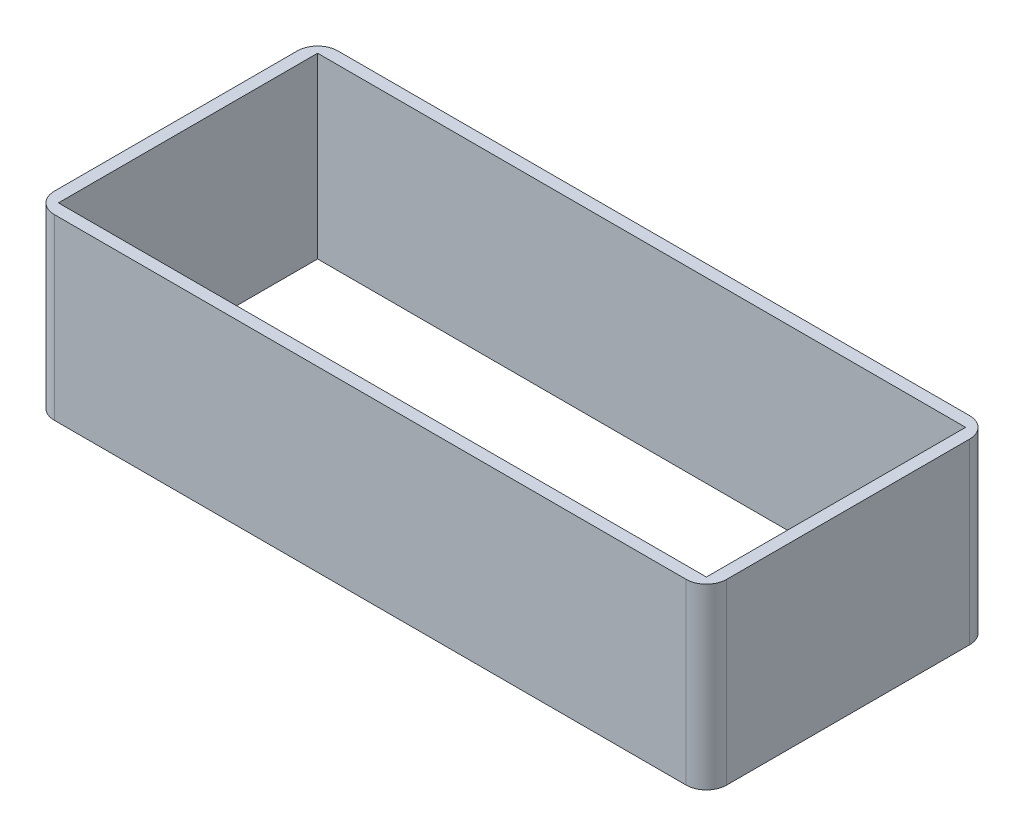
ISO-10303-21;
HEADER;
FILE_DESCRIPTION(('STEP AP214'),'2;1');
FILE_NAME('part.step','',(''),(''),'','','');
FILE_SCHEMA(('AUTOMOTIVE_DESIGN { 1 0 10303 214 1 1 1 1 }'));
ENDSEC;
DATA;
#1=APPLICATION_CONTEXT('core data for automotive mechanical design processes');
#2=APPLICATION_PROTOCOL_DEFINITION('international standard','automotive_design',2000,#1);
#3=PRODUCT_CONTEXT('',#1,'mechanical');
#4=PRODUCT('Part','Part','',(#3));
#5=PRODUCT_RELATED_PRODUCT_CATEGORY('part','',(#4));
#6=PRODUCT_DEFINITION_FORMATION('','',#4);
#7=PRODUCT_DEFINITION_CONTEXT('part definition',#1,'design');
#8=PRODUCT_DEFINITION('design','',#6,#7);
#9=PRODUCT_DEFINITION_SHAPE('','',#8);
#10=(LENGTH_UNIT() NAMED_UNIT(*) SI_UNIT(.MILLI.,.METRE.));
#11=(NAMED_UNIT(*) PLANE_ANGLE_UNIT() SI_UNIT($,.RADIAN.));
#12=(NAMED_UNIT(*) SI_UNIT($,.STERADIAN.) SOLID_ANGLE_UNIT());
#13=UNCERTAINTY_MEASURE_WITH_UNIT(LENGTH_MEASURE(1.E-05),#10,'distance_accuracy_value','');
#14=(GEOMETRIC_REPRESENTATION_CONTEXT(3) GLOBAL_UNCERTAINTY_ASSIGNED_CONTEXT((#13)) GLOBAL_UNIT_ASSIGNED_CONTEXT((#10,
#11,#12)) REPRESENTATION_CONTEXT('',''));
#15=CARTESIAN_POINT('',(0.,0.,0.));
#16=DIRECTION('',(0.,0.,1.));
#17=DIRECTION('',(1.,0.,0.));
#18=AXIS2_PLACEMENT_3D('',#15,#16,#17);
#19=CARTESIAN_POINT('',(0.,47.,0.));
#20=DIRECTION('',(0.,1.,0.));
#21=DIRECTION('',(0.,0.,1.));
#22=AXIS2_PLACEMENT_3D('',#19,#20,#21);
#23=PLANE('',#22);
#24=DIRECTION('',(0.,0.,1.));
#25=VECTOR('',#24,1.);
#26=CARTESIAN_POINT('',(-95.3544303797468,47.,-47.8481012658228));
#27=LINE('',#26,#25);
#28=CARTESIAN_POINT('',(-95.3544303797468,47.,-44.8481012658228));
#29=VERTEX_POINT('',#28);
#30=CARTESIAN_POINT('',(-95.3544303797468,47.,19.1518987341772));
#31=VERTEX_POINT('',#30);
#32=EDGE_CURVE('E11',#29,#31,#27,.T.);
#33=ORIENTED_EDGE('',*,*,#32,.F.);
#34=DIRECTION('',(-1.,0.,0.));
#35=VECTOR('',#34,1.);
#36=CARTESIAN_POINT('',(-98.3544303797468,47.,-44.8481012658228));
#37=LINE('',#36,#35);
#38=CARTESIAN_POINT('',(64.6371308016878,47.,-44.8481012658228));
#39=VERTEX_POINT('',#38);
#40=EDGE_CURVE('E193',#39,#29,#37,.T.);
#41=ORIENTED_EDGE('',*,*,#40,.F.);
#42=DIRECTION('',(0.,0.,-1.));
#43=VECTOR('',#42,1.);
#44=CARTESIAN_POINT('',(64.6371308016878,47.,-47.8481012658228));
#45=LINE('',#44,#43);
#46=CARTESIAN_POINT('',(64.6371308016878,47.,19.1518987341772));
#47=VERTEX_POINT('',#46);
#48=EDGE_CURVE('E196',#47,#39,#45,.T.);
#49=ORIENTED_EDGE('',*,*,#48,.F.);
#50=DIRECTION('',(1.,0.,0.));
#51=VECTOR('',#50,1.);
#52=CARTESIAN_POINT('',(-98.3544303797468,47.,19.1518987341772));
#53=LINE('',#52,#51);
#54=EDGE_CURVE('E41',#31,#47,#53,.T.);
#55=ORIENTED_EDGE('',*,*,#54,.F.);
#56=EDGE_LOOP('',(#33,#41,#49,#55));
#57=FACE_BOUND('',#56,.T.);
#58=CARTESIAN_POINT('',(62.6371308016877,47.,-42.8481012658228));
#59=DIRECTION('',(0.,1.,0.));
#60=DIRECTION('',(0.,0.,1.));
#61=AXIS2_PLACEMENT_3D('',#58,#59,#60);
#62=CIRCLE('',#61,5.);
#63=CARTESIAN_POINT('',(62.6371308016877,47.,-47.8481012658228));
#64=VERTEX_POINT('',#63);
#65=CARTESIAN_POINT('',(67.6371308016878,47.,-42.8481012658228));
#66=VERTEX_POINT('',#65);
#67=EDGE_CURVE('E185',#64,#66,#62,.F.);
#68=ORIENTED_EDGE('',*,*,#67,.F.);
#69=DIRECTION('',(-1.,0.,0.));
#70=VECTOR('',#69,1.);
#71=CARTESIAN_POINT('',(-98.3544303797468,47.,-47.8481012658228));
#72=LINE('',#71,#70);
#73=CARTESIAN_POINT('',(-93.3544303797468,47.,-47.8481012658228));
#74=VERTEX_POINT('',#73);
#75=EDGE_CURVE('E166',#64,#74,#72,.T.);
#76=ORIENTED_EDGE('',*,*,#75,.T.);
#77=CARTESIAN_POINT('',(-93.3544303797468,47.,-42.8481012658228));
#78=DIRECTION('',(0.,1.,0.));
#79=DIRECTION('',(0.,0.,1.));
#80=AXIS2_PLACEMENT_3D('',#77,#78,#79);
#81=CIRCLE('',#80,5.);
#82=CARTESIAN_POINT('',(-98.3544303797468,47.,-42.8481012658228));
#83=VERTEX_POINT('',#82);
#84=EDGE_CURVE('E182',#83,#74,#81,.F.);
#85=ORIENTED_EDGE('',*,*,#84,.F.);
#86=DIRECTION('',(0.,0.,1.));
#87=VECTOR('',#86,1.);
#88=CARTESIAN_POINT('',(-98.3544303797468,47.,-47.8481012658228));
#89=LINE('',#88,#87);
#90=CARTESIAN_POINT('',(-98.3544303797468,47.,17.1518987341772));
#91=VERTEX_POINT('',#90);
#92=EDGE_CURVE('E179',#83,#91,#89,.T.);
#93=ORIENTED_EDGE('',*,*,#92,.T.);
#94=CARTESIAN_POINT('',(-93.3544303797468,47.,17.1518987341772));
#95=DIRECTION('',(0.,1.,0.));
#96=DIRECTION('',(0.,0.,1.));
#97=AXIS2_PLACEMENT_3D('',#94,#95,#96);
#98=CIRCLE('',#97,5.);
#99=CARTESIAN_POINT('',(-93.3544303797468,47.,22.1518987341772));
#100=VERTEX_POINT('',#99);
#101=EDGE_CURVE('E191',#100,#91,#98,.F.);
#102=ORIENTED_EDGE('',*,*,#101,.F.);
#103=DIRECTION('',(1.,0.,0.));
#104=VECTOR('',#103,1.);
#105=CARTESIAN_POINT('',(-98.3544303797468,47.,22.1518987341772));
#106=LINE('',#105,#104);
#107=CARTESIAN_POINT('',(62.6371308016878,47.,22.1518987341772));
#108=VERTEX_POINT('',#107);
#109=EDGE_CURVE('E175',#100,#108,#106,.T.);
#110=ORIENTED_EDGE('',*,*,#109,.T.);
#111=CARTESIAN_POINT('',(62.6371308016878,47.,17.1518987341772));
#112=DIRECTION('',(0.,1.,0.));
#113=DIRECTION('',(0.,0.,1.));
#114=AXIS2_PLACEMENT_3D('',#111,#112,#113);
#115=CIRCLE('',#114,5.);
#116=CARTESIAN_POINT('',(67.6371308016878,47.,17.1518987341772));
#117=VERTEX_POINT('',#116);
#118=EDGE_CURVE('E188',#117,#108,#115,.F.);
#119=ORIENTED_EDGE('',*,*,#118,.F.);
#120=DIRECTION('',(0.,0.,-1.));
#121=VECTOR('',#120,1.);
#122=CARTESIAN_POINT('',(67.6371308016878,47.,-47.8481012658228));
#123=LINE('',#122,#121);
#124=EDGE_CURVE('E171',#117,#66,#123,.T.);
#125=ORIENTED_EDGE('',*,*,#124,.T.);
#126=EDGE_LOOP('',(#68,#76,#85,#93,#102,#110,#119,#125));
#127=FACE_BOUND('',#126,.T.);
#128=ADVANCED_FACE('F33',(#57,#127),#23,.T.);
#129=CARTESIAN_POINT('',(0.,3.,0.));
#130=DIRECTION('',(0.,-1.,0.));
#131=DIRECTION('',(0.,0.,-1.));
#132=AXIS2_PLACEMENT_3D('',#129,#130,#131);
#133=PLANE('',#132);
#134=DIRECTION('',(-1.,0.,0.));
#135=VECTOR('',#134,1.);
#136=CARTESIAN_POINT('',(-98.3544303797468,3.,-44.8481012658228));
#137=LINE('',#136,#135);
#138=CARTESIAN_POINT('',(64.6371308016878,3.,-44.8481012658228));
#139=VERTEX_POINT('',#138);
#140=CARTESIAN_POINT('',(-95.3544303797468,3.,-44.8481012658228));
#141=VERTEX_POINT('',#140);
#142=EDGE_CURVE('E138',#139,#141,#137,.T.);
#143=ORIENTED_EDGE('',*,*,#142,.T.);
#144=DIRECTION('',(0.,0.,1.));
#145=VECTOR('',#144,1.);
#146=CARTESIAN_POINT('',(-95.3544303797468,3.,-47.8481012658228));
#147=LINE('',#146,#145);
#148=CARTESIAN_POINT('',(-95.3544303797468,3.,19.1518987341772));
#149=VERTEX_POINT('',#148);
#150=EDGE_CURVE('E121',#141,#149,#147,.T.);
#151=ORIENTED_EDGE('',*,*,#150,.T.);
#152=DIRECTION('',(1.,0.,0.));
#153=VECTOR('',#152,1.);
#154=CARTESIAN_POINT('',(-98.3544303797468,3.,19.1518987341772));
#155=LINE('',#154,#153);
#156=CARTESIAN_POINT('',(64.6371308016878,3.,19.1518987341772));
#157=VERTEX_POINT('',#156);
#158=EDGE_CURVE('E126',#149,#157,#155,.T.);
#159=ORIENTED_EDGE('',*,*,#158,.T.);
#160=DIRECTION('',(0.,0.,-1.));
#161=VECTOR('',#160,1.);
#162=CARTESIAN_POINT('',(64.6371308016878,3.,-47.8481012658228));
#163=LINE('',#162,#161);
#164=EDGE_CURVE('E132',#157,#139,#163,.T.);
#165=ORIENTED_EDGE('',*,*,#164,.T.);
#166=EDGE_LOOP('',(#143,#151,#159,#165));
#167=FACE_BOUND('',#166,.T.);
#168=CARTESIAN_POINT('',(62.6371308016877,3.,-42.8481012658228));
#169=DIRECTION('',(0.,-1.,0.));
#170=DIRECTION('',(0.,0.,-1.));
#171=AXIS2_PLACEMENT_3D('',#168,#169,#170);
#172=CIRCLE('',#171,5.);
#173=CARTESIAN_POINT('',(67.6371308016878,3.,-42.8481012658228));
#174=VERTEX_POINT('',#173);
#175=CARTESIAN_POINT('',(62.6371308016877,3.,-47.8481012658228));
#176=VERTEX_POINT('',#175);
#177=EDGE_CURVE('E187',#174,#176,#172,.F.);
#178=ORIENTED_EDGE('',*,*,#177,.F.);
#179=DIRECTION('',(0.,0.,1.));
#180=VECTOR('',#179,1.);
#181=CARTESIAN_POINT('',(67.6371308016878,3.,-47.8481012658228));
#182=LINE('',#181,#180);
#183=CARTESIAN_POINT('',(67.6371308016878,3.,17.1518987341772));
#184=VERTEX_POINT('',#183);
#185=EDGE_CURVE('E169',#174,#184,#182,.T.);
#186=ORIENTED_EDGE('',*,*,#185,.T.);
#187=CARTESIAN_POINT('',(62.6371308016878,3.,17.1518987341772));
#188=DIRECTION('',(0.,-1.,0.));
#189=DIRECTION('',(0.,0.,-1.));
#190=AXIS2_PLACEMENT_3D('',#187,#188,#189);
#191=CIRCLE('',#190,5.);
#192=CARTESIAN_POINT('',(62.6371308016878,3.,22.1518987341772));
#193=VERTEX_POINT('',#192);
#194=EDGE_CURVE('E190',#193,#184,#191,.F.);
#195=ORIENTED_EDGE('',*,*,#194,.F.);
#196=DIRECTION('',(-1.,0.,0.));
#197=VECTOR('',#196,1.);
#198=CARTESIAN_POINT('',(-98.3544303797468,3.,22.1518987341772));
#199=LINE('',#198,#197);
#200=CARTESIAN_POINT('',(-93.3544303797468,3.,22.1518987341772));
#201=VERTEX_POINT('',#200);
#202=EDGE_CURVE('E174',#193,#201,#199,.T.);
#203=ORIENTED_EDGE('',*,*,#202,.T.);
#204=CARTESIAN_POINT('',(-93.3544303797468,3.,17.1518987341772));
#205=DIRECTION('',(0.,-1.,0.));
#206=DIRECTION('',(0.,0.,-1.));
#207=AXIS2_PLACEMENT_3D('',#204,#205,#206);
#208=CIRCLE('',#207,5.);
#209=CARTESIAN_POINT('',(-98.3544303797468,3.,17.1518987341772));
#210=VERTEX_POINT('',#209);
#211=EDGE_CURVE('E165',#210,#201,#208,.F.);
#212=ORIENTED_EDGE('',*,*,#211,.F.);
#213=DIRECTION('',(0.,0.,-1.));
#214=VECTOR('',#213,1.);
#215=CARTESIAN_POINT('',(-98.3544303797468,3.,-47.8481012658228));
#216=LINE('',#215,#214);
#217=CARTESIAN_POINT('',(-98.3544303797468,3.,-42.8481012658228));
#218=VERTEX_POINT('',#217);
#219=EDGE_CURVE('E178',#210,#218,#216,.T.);
#220=ORIENTED_EDGE('',*,*,#219,.T.);
#221=CARTESIAN_POINT('',(-93.3544303797468,3.,-42.8481012658228));
#222=DIRECTION('',(0.,-1.,0.));
#223=DIRECTION('',(0.,0.,-1.));
#224=AXIS2_PLACEMENT_3D('',#221,#222,#223);
#225=CIRCLE('',#224,5.);
#226=CARTESIAN_POINT('',(-93.3544303797468,3.,-47.8481012658228));
#227=VERTEX_POINT('',#226);
#228=EDGE_CURVE('E184',#227,#218,#225,.F.);
#229=ORIENTED_EDGE('',*,*,#228,.F.);
#230=DIRECTION('',(1.,0.,0.));
#231=VECTOR('',#230,1.);
#232=CARTESIAN_POINT('',(-98.3544303797468,3.,-47.8481012658228));
#233=LINE('',#232,#231);
#234=EDGE_CURVE('E170',#227,#176,#233,.T.);
#235=ORIENTED_EDGE('',*,*,#234,.T.);
#236=EDGE_LOOP('',(#178,#186,#195,#203,#212,#220,#229,#235));
#237=FACE_BOUND('',#236,.T.);
#238=ADVANCED_FACE('F135',(#167,#237),#133,.T.);
#239=CARTESIAN_POINT('',(-98.3544303797468,47.,19.1518987341772));
#240=DIRECTION('',(0.,0.,-1.));
#241=DIRECTION('',(-1.,0.,0.));
#242=AXIS2_PLACEMENT_3D('',#239,#240,#241);
#243=PLANE('',#242);
#244=ORIENTED_EDGE('',*,*,#158,.F.);
#245=DIRECTION('',(0.,-1.,0.));
#246=VECTOR('',#245,1.);
#247=CARTESIAN_POINT('',(-95.3544303797468,47.,19.1518987341772));
#248=LINE('',#247,#246);
#249=EDGE_CURVE('E117',#31,#149,#248,.T.);
#250=ORIENTED_EDGE('',*,*,#249,.F.);
#251=ORIENTED_EDGE('',*,*,#54,.T.);
#252=DIRECTION('',(0.,-1.,0.));
#253=VECTOR('',#252,1.);
#254=CARTESIAN_POINT('',(64.6371308016878,47.,19.1518987341772));
#255=LINE('',#254,#253);
#256=EDGE_CURVE('E122',#47,#157,#255,.T.);
#257=ORIENTED_EDGE('',*,*,#256,.T.);
#258=EDGE_LOOP('',(#244,#250,#251,#257));
#259=FACE_BOUND('',#258,.T.);
#260=ADVANCED_FACE('F127',(#259),#243,.T.);
#261=CARTESIAN_POINT('',(-95.3544303797468,47.,-47.8481012658228));
#262=DIRECTION('',(1.,0.,0.));
#263=DIRECTION('',(0.,0.,-1.));
#264=AXIS2_PLACEMENT_3D('',#261,#262,#263);
#265=PLANE('',#264);
#266=ORIENTED_EDGE('',*,*,#150,.F.);
#267=DIRECTION('',(0.,-1.,0.));
#268=VECTOR('',#267,1.);
#269=CARTESIAN_POINT('',(-95.3544303797468,47.,-44.8481012658228));
#270=LINE('',#269,#268);
#271=EDGE_CURVE('E197',#29,#141,#270,.T.);
#272=ORIENTED_EDGE('',*,*,#271,.F.);
#273=ORIENTED_EDGE('',*,*,#32,.T.);
#274=ORIENTED_EDGE('',*,*,#249,.T.);
#275=EDGE_LOOP('',(#266,#272,#273,#274));
#276=FACE_BOUND('',#275,.T.);
#277=ADVANCED_FACE('F119',(#276),#265,.T.);
#278=CARTESIAN_POINT('',(64.6371308016878,47.,-47.8481012658228));
#279=DIRECTION('',(-1.,0.,0.));
#280=DIRECTION('',(0.,0.,1.));
#281=AXIS2_PLACEMENT_3D('',#278,#279,#280);
#282=PLANE('',#281);
#283=ORIENTED_EDGE('',*,*,#164,.F.);
#284=ORIENTED_EDGE('',*,*,#256,.F.);
#285=ORIENTED_EDGE('',*,*,#48,.T.);
#286=DIRECTION('',(0.,-1.,0.));
#287=VECTOR('',#286,1.);
#288=CARTESIAN_POINT('',(64.6371308016878,47.,-44.8481012658228));
#289=LINE('',#288,#287);
#290=EDGE_CURVE('E202',#39,#139,#289,.T.);
#291=ORIENTED_EDGE('',*,*,#290,.T.);
#292=EDGE_LOOP('',(#283,#284,#285,#291));
#293=FACE_BOUND('',#292,.T.);
#294=ADVANCED_FACE('F200',(#293),#282,.T.);
#295=CARTESIAN_POINT('',(-98.3544303797468,47.,-44.8481012658228));
#296=DIRECTION('',(0.,0.,1.));
#297=DIRECTION('',(1.,0.,0.));
#298=AXIS2_PLACEMENT_3D('',#295,#296,#297);
#299=PLANE('',#298);
#300=ORIENTED_EDGE('',*,*,#142,.F.);
#301=ORIENTED_EDGE('',*,*,#290,.F.);
#302=ORIENTED_EDGE('',*,*,#40,.T.);
#303=ORIENTED_EDGE('',*,*,#271,.T.);
#304=EDGE_LOOP('',(#300,#301,#302,#303));
#305=FACE_BOUND('',#304,.T.);
#306=ADVANCED_FACE('F206',(#305),#299,.T.);
#307=CARTESIAN_POINT('',(-98.3544303797468,50.,-47.8481012658228));
#308=DIRECTION('',(1.,0.,0.));
#309=DIRECTION('',(0.,0.,-1.));
#310=AXIS2_PLACEMENT_3D('',#307,#308,#309);
#311=PLANE('',#310);
#312=ORIENTED_EDGE('',*,*,#92,.F.);
#313=DIRECTION('',(0.,-1.,0.));
#314=VECTOR('',#313,1.);
#315=CARTESIAN_POINT('',(-98.3544303797468,50.,-42.8481012658228));
#316=LINE('',#315,#314);
#317=EDGE_CURVE('E144',#83,#218,#316,.T.);
#318=ORIENTED_EDGE('',*,*,#317,.T.);
#319=ORIENTED_EDGE('',*,*,#219,.F.);
#320=DIRECTION('',(0.,-1.,0.));
#321=VECTOR('',#320,1.);
#322=CARTESIAN_POINT('',(-98.3544303797468,50.,17.1518987341772));
#323=LINE('',#322,#321);
#324=EDGE_CURVE('E123',#210,#91,#323,.F.);
#325=ORIENTED_EDGE('',*,*,#324,.T.);
#326=EDGE_LOOP('',(#312,#318,#319,#325));
#327=FACE_BOUND('',#326,.T.);
#328=ADVANCED_FACE('F250',(#327),#311,.F.);
#329=CARTESIAN_POINT('',(-98.3544303797468,50.,22.1518987341772));
#330=DIRECTION('',(0.,0.,-1.));
#331=DIRECTION('',(-1.,0.,0.));
#332=AXIS2_PLACEMENT_3D('',#329,#330,#331);
#333=PLANE('',#332);
#334=ORIENTED_EDGE('',*,*,#109,.F.);
#335=DIRECTION('',(0.,-1.,0.));
#336=VECTOR('',#335,1.);
#337=CARTESIAN_POINT('',(-93.3544303797468,50.,22.1518987341772));
#338=LINE('',#337,#336);
#339=EDGE_CURVE('E159',#100,#201,#338,.T.);
#340=ORIENTED_EDGE('',*,*,#339,.T.);
#341=ORIENTED_EDGE('',*,*,#202,.F.);
#342=DIRECTION('',(0.,-1.,0.));
#343=VECTOR('',#342,1.);
#344=CARTESIAN_POINT('',(62.6371308016878,50.,22.1518987341772));
#345=LINE('',#344,#343);
#346=EDGE_CURVE('E162',#193,#108,#345,.F.);
#347=ORIENTED_EDGE('',*,*,#346,.T.);
#348=EDGE_LOOP('',(#334,#340,#341,#347));
#349=FACE_BOUND('',#348,.T.);
#350=ADVANCED_FACE('F242',(#349),#333,.F.);
#351=CARTESIAN_POINT('',(-93.3544303797468,50.,17.1518987341772));
#352=DIRECTION('',(0.,-1.,0.));
#353=DIRECTION('',(0.,0.,-1.));
#354=AXIS2_PLACEMENT_3D('',#351,#352,#353);
#355=CYLINDRICAL_SURFACE('',#354,5.);
#356=ORIENTED_EDGE('',*,*,#339,.F.);
#357=ORIENTED_EDGE('',*,*,#101,.T.);
#358=ORIENTED_EDGE('',*,*,#324,.F.);
#359=ORIENTED_EDGE('',*,*,#211,.T.);
#360=EDGE_LOOP('',(#356,#357,#358,#359));
#361=FACE_BOUND('',#360,.T.);
#362=ADVANCED_FACE('F35',(#361),#355,.T.);
#363=CARTESIAN_POINT('',(67.6371308016878,50.,-47.8481012658228));
#364=DIRECTION('',(-1.,0.,0.));
#365=DIRECTION('',(0.,0.,1.));
#366=AXIS2_PLACEMENT_3D('',#363,#364,#365);
#367=PLANE('',#366);
#368=ORIENTED_EDGE('',*,*,#124,.F.);
#369=DIRECTION('',(0.,-1.,0.));
#370=VECTOR('',#369,1.);
#371=CARTESIAN_POINT('',(67.6371308016878,50.,17.1518987341772));
#372=LINE('',#371,#370);
#373=EDGE_CURVE('E153',#117,#184,#372,.T.);
#374=ORIENTED_EDGE('',*,*,#373,.T.);
#375=ORIENTED_EDGE('',*,*,#185,.F.);
#376=DIRECTION('',(0.,-1.,0.));
#377=VECTOR('',#376,1.);
#378=CARTESIAN_POINT('',(67.6371308016878,50.,-42.8481012658228));
#379=LINE('',#378,#377);
#380=EDGE_CURVE('E156',#174,#66,#379,.F.);
#381=ORIENTED_EDGE('',*,*,#380,.T.);
#382=EDGE_LOOP('',(#368,#374,#375,#381));
#383=FACE_BOUND('',#382,.T.);
#384=ADVANCED_FACE('F235',(#383),#367,.F.);
#385=CARTESIAN_POINT('',(62.6371308016878,50.,17.1518987341772));
#386=DIRECTION('',(0.,-1.,0.));
#387=DIRECTION('',(0.,0.,-1.));
#388=AXIS2_PLACEMENT_3D('',#385,#386,#387);
#389=CYLINDRICAL_SURFACE('',#388,5.);
#390=ORIENTED_EDGE('',*,*,#373,.F.);
#391=ORIENTED_EDGE('',*,*,#118,.T.);
#392=ORIENTED_EDGE('',*,*,#346,.F.);
#393=ORIENTED_EDGE('',*,*,#194,.T.);
#394=EDGE_LOOP('',(#390,#391,#392,#393));
#395=FACE_BOUND('',#394,.T.);
#396=ADVANCED_FACE('F244',(#395),#389,.T.);
#397=CARTESIAN_POINT('',(-98.3544303797468,50.,-47.8481012658228));
#398=DIRECTION('',(0.,0.,1.));
#399=DIRECTION('',(1.,0.,0.));
#400=AXIS2_PLACEMENT_3D('',#397,#398,#399);
#401=PLANE('',#400);
#402=ORIENTED_EDGE('',*,*,#75,.F.);
#403=DIRECTION('',(0.,-1.,0.));
#404=VECTOR('',#403,1.);
#405=CARTESIAN_POINT('',(62.6371308016877,50.,-47.8481012658228));
#406=LINE('',#405,#404);
#407=EDGE_CURVE('E147',#64,#176,#406,.T.);
#408=ORIENTED_EDGE('',*,*,#407,.T.);
#409=ORIENTED_EDGE('',*,*,#234,.F.);
#410=DIRECTION('',(0.,-1.,0.));
#411=VECTOR('',#410,1.);
#412=CARTESIAN_POINT('',(-93.3544303797468,50.,-47.8481012658228));
#413=LINE('',#412,#411);
#414=EDGE_CURVE('E150',#227,#74,#413,.F.);
#415=ORIENTED_EDGE('',*,*,#414,.T.);
#416=EDGE_LOOP('',(#402,#408,#409,#415));
#417=FACE_BOUND('',#416,.T.);
#418=ADVANCED_FACE('F229',(#417),#401,.F.);
#419=CARTESIAN_POINT('',(62.6371308016877,50.,-42.8481012658228));
#420=DIRECTION('',(0.,-1.,0.));
#421=DIRECTION('',(0.,0.,-1.));
#422=AXIS2_PLACEMENT_3D('',#419,#420,#421);
#423=CYLINDRICAL_SURFACE('',#422,5.);
#424=ORIENTED_EDGE('',*,*,#407,.F.);
#425=ORIENTED_EDGE('',*,*,#67,.T.);
#426=ORIENTED_EDGE('',*,*,#380,.F.);
#427=ORIENTED_EDGE('',*,*,#177,.T.);
#428=EDGE_LOOP('',(#424,#425,#426,#427));
#429=FACE_BOUND('',#428,.T.);
#430=ADVANCED_FACE('F231',(#429),#423,.T.);
#431=CARTESIAN_POINT('',(-93.3544303797468,50.,-42.8481012658228));
#432=DIRECTION('',(0.,-1.,0.));
#433=DIRECTION('',(0.,0.,-1.));
#434=AXIS2_PLACEMENT_3D('',#431,#432,#433);
#435=CYLINDRICAL_SURFACE('',#434,5.);
#436=ORIENTED_EDGE('',*,*,#317,.F.);
#437=ORIENTED_EDGE('',*,*,#84,.T.);
#438=ORIENTED_EDGE('',*,*,#414,.F.);
#439=ORIENTED_EDGE('',*,*,#228,.T.);
#440=EDGE_LOOP('',(#436,#437,#438,#439));
#441=FACE_BOUND('',#440,.T.);
#442=ADVANCED_FACE('F253',(#441),#435,.T.);
#443=CLOSED_SHELL('',(#128,#238,#260,#277,#294,#306,#328,#350,#362,#384,#396,#418,#430,#442));
#444=MANIFOLD_SOLID_BREP('B2',#443);
#445=ADVANCED_BREP_SHAPE_REPRESENTATION('',(#18,#444),#14);
#446=SHAPE_DEFINITION_REPRESENTATION(#9,#445);
ENDSEC;
END-ISO-10303-21;
